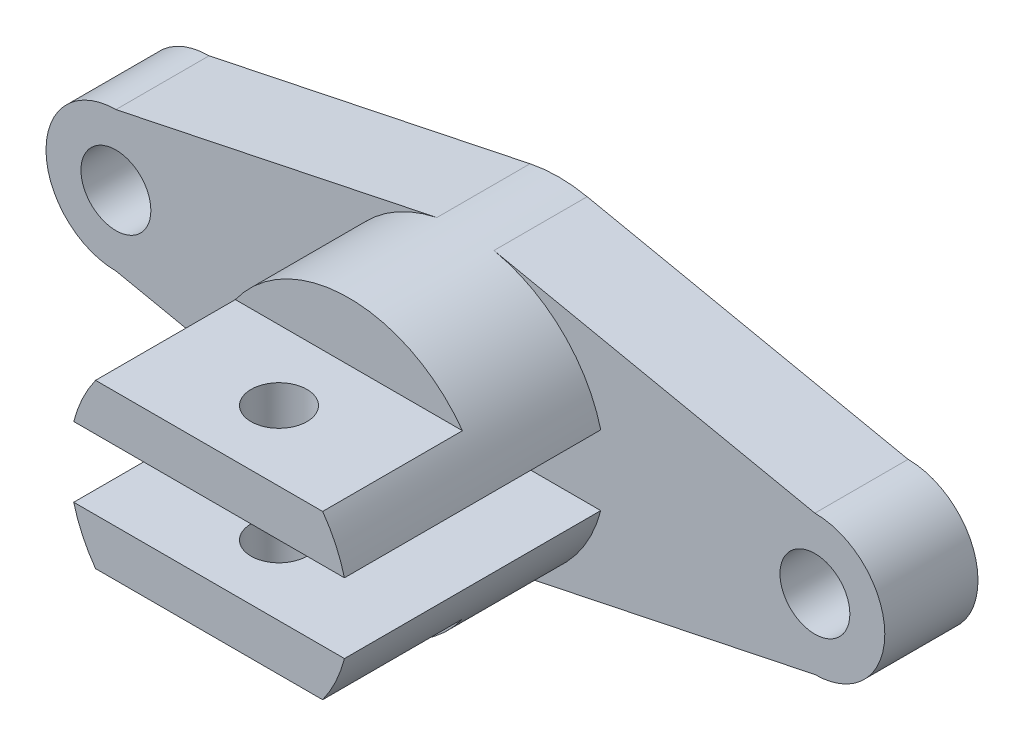
ISO-10303-21;
HEADER;
FILE_DESCRIPTION(('STEP AP214'),'2;1');
FILE_NAME('part.step','',(''),(''),'','','');
FILE_SCHEMA(('AUTOMOTIVE_DESIGN { 1 0 10303 214 1 1 1 1 }'));
ENDSEC;
DATA;
#1=APPLICATION_CONTEXT('core data for automotive mechanical design processes');
#2=APPLICATION_PROTOCOL_DEFINITION('international standard','automotive_design',2000,#1);
#3=PRODUCT_CONTEXT('',#1,'mechanical');
#4=PRODUCT('Part','Part','',(#3));
#5=PRODUCT_RELATED_PRODUCT_CATEGORY('part','',(#4));
#6=PRODUCT_DEFINITION_FORMATION('','',#4);
#7=PRODUCT_DEFINITION_CONTEXT('part definition',#1,'design');
#8=PRODUCT_DEFINITION('design','',#6,#7);
#9=PRODUCT_DEFINITION_SHAPE('','',#8);
#10=(LENGTH_UNIT() NAMED_UNIT(*) SI_UNIT(.MILLI.,.METRE.));
#11=(NAMED_UNIT(*) PLANE_ANGLE_UNIT() SI_UNIT($,.RADIAN.));
#12=(NAMED_UNIT(*) SI_UNIT($,.STERADIAN.) SOLID_ANGLE_UNIT());
#13=UNCERTAINTY_MEASURE_WITH_UNIT(LENGTH_MEASURE(1.E-05),#10,'distance_accuracy_value','');
#14=(GEOMETRIC_REPRESENTATION_CONTEXT(3) GLOBAL_UNCERTAINTY_ASSIGNED_CONTEXT((#13)) GLOBAL_UNIT_ASSIGNED_CONTEXT((#10,
#11,#12)) REPRESENTATION_CONTEXT('',''));
#15=CARTESIAN_POINT('',(0.,0.,0.));
#16=DIRECTION('',(0.,0.,1.));
#17=DIRECTION('',(1.,0.,0.));
#18=AXIS2_PLACEMENT_3D('',#15,#16,#17);
#19=CARTESIAN_POINT('',(-6.12644335404989,29.3677832297506,20.));
#20=DIRECTION('',(-0.20421477846833,0.978926107658352,0.));
#21=DIRECTION('',(-0.978926107658352,-0.20421477846833,0.));
#22=AXIS2_PLACEMENT_3D('',#19,#20,#21);
#23=PLANE('',#22);
#24=DIRECTION('',(0.978926107658352,0.20421477846833,0.));
#25=VECTOR('',#24,1.);
#26=CARTESIAN_POINT('',(-6.12644335404989,29.3677832297506,0.));
#27=LINE('',#26,#25);
#28=CARTESIAN_POINT('',(-75.,15.,0.));
#29=VERTEX_POINT('',#28);
#30=CARTESIAN_POINT('',(-6.12644335404989,29.3677832297506,0.));
#31=VERTEX_POINT('',#30);
#32=EDGE_CURVE('E223',#29,#31,#27,.T.);
#33=ORIENTED_EDGE('',*,*,#32,.F.);
#34=DIRECTION('',(0.,0.,-1.));
#35=VECTOR('',#34,1.);
#36=CARTESIAN_POINT('',(-75.,15.,20.));
#37=LINE('',#36,#35);
#38=CARTESIAN_POINT('',(-75.,15.,20.));
#39=VERTEX_POINT('',#38);
#40=EDGE_CURVE('E57',#39,#29,#37,.T.);
#41=ORIENTED_EDGE('',*,*,#40,.F.);
#42=DIRECTION('',(0.978926107658352,0.20421477846833,0.));
#43=VECTOR('',#42,1.);
#44=CARTESIAN_POINT('',(-6.12644335404989,29.3677832297506,20.));
#45=LINE('',#44,#43);
#46=CARTESIAN_POINT('',(-6.12644335404989,29.3677832297506,20.));
#47=VERTEX_POINT('',#46);
#48=EDGE_CURVE('E233',#39,#47,#45,.T.);
#49=ORIENTED_EDGE('',*,*,#48,.T.);
#50=DIRECTION('',(0.,0.,-1.));
#51=VECTOR('',#50,1.);
#52=CARTESIAN_POINT('',(-6.12644335404989,29.3677832297506,20.));
#53=LINE('',#52,#51);
#54=EDGE_CURVE('E11',#47,#31,#53,.T.);
#55=ORIENTED_EDGE('',*,*,#54,.T.);
#56=EDGE_LOOP('',(#33,#41,#49,#55));
#57=FACE_BOUND('',#56,.T.);
#58=ADVANCED_FACE('F47',(#57),#23,.T.);
#59=CARTESIAN_POINT('',(-75.,0.,20.));
#60=DIRECTION('',(0.,0.,-1.));
#61=DIRECTION('',(-1.,0.,0.));
#62=AXIS2_PLACEMENT_3D('',#59,#60,#61);
#63=CYLINDRICAL_SURFACE('',#62,15.);
#64=CARTESIAN_POINT('',(-75.,0.,0.));
#65=DIRECTION('',(0.,0.,1.));
#66=DIRECTION('',(1.,0.,0.));
#67=AXIS2_PLACEMENT_3D('',#64,#65,#66);
#68=CIRCLE('',#67,15.);
#69=CARTESIAN_POINT('',(-75.,-15.,0.));
#70=VERTEX_POINT('',#69);
#71=EDGE_CURVE('E262',#29,#70,#68,.T.);
#72=ORIENTED_EDGE('',*,*,#71,.T.);
#73=DIRECTION('',(0.,0.,-1.));
#74=VECTOR('',#73,1.);
#75=CARTESIAN_POINT('',(-75.,-15.,20.));
#76=LINE('',#75,#74);
#77=CARTESIAN_POINT('',(-75.,-15.,20.));
#78=VERTEX_POINT('',#77);
#79=EDGE_CURVE('E300',#78,#70,#76,.T.);
#80=ORIENTED_EDGE('',*,*,#79,.F.);
#81=CARTESIAN_POINT('',(-75.,0.,20.));
#82=DIRECTION('',(0.,0.,1.));
#83=DIRECTION('',(1.,0.,0.));
#84=AXIS2_PLACEMENT_3D('',#81,#82,#83);
#85=CIRCLE('',#84,15.);
#86=EDGE_CURVE('E237',#39,#78,#85,.T.);
#87=ORIENTED_EDGE('',*,*,#86,.F.);
#88=ORIENTED_EDGE('',*,*,#40,.T.);
#89=EDGE_LOOP('',(#72,#80,#87,#88));
#90=FACE_BOUND('',#89,.T.);
#91=ADVANCED_FACE('F308',(#90),#63,.T.);
#92=CARTESIAN_POINT('',(-6.12644335404988,-29.3677832297505,20.));
#93=DIRECTION('',(0.204214778468329,0.978926107658352,0.));
#94=DIRECTION('',(-0.978926107658352,0.204214778468329,0.));
#95=AXIS2_PLACEMENT_3D('',#92,#93,#94);
#96=PLANE('',#95);
#97=DIRECTION('',(0.978926107658352,-0.204214778468329,0.));
#98=VECTOR('',#97,1.);
#99=CARTESIAN_POINT('',(-6.12644335404988,-29.3677832297505,0.));
#100=LINE('',#99,#98);
#101=CARTESIAN_POINT('',(-6.12644335404989,-29.3677832297505,0.));
#102=VERTEX_POINT('',#101);
#103=EDGE_CURVE('E265',#70,#102,#100,.T.);
#104=ORIENTED_EDGE('',*,*,#103,.T.);
#105=DIRECTION('',(0.,0.,-1.));
#106=VECTOR('',#105,1.);
#107=CARTESIAN_POINT('',(-6.12644335404989,-29.3677832297505,20.));
#108=LINE('',#107,#106);
#109=CARTESIAN_POINT('',(-6.12644335404988,-29.3677832297505,20.));
#110=VERTEX_POINT('',#109);
#111=EDGE_CURVE('E296',#110,#102,#108,.T.);
#112=ORIENTED_EDGE('',*,*,#111,.F.);
#113=DIRECTION('',(0.978926107658352,-0.204214778468329,0.));
#114=VECTOR('',#113,1.);
#115=CARTESIAN_POINT('',(-6.12644335404988,-29.3677832297505,20.));
#116=LINE('',#115,#114);
#117=EDGE_CURVE('E240',#78,#110,#116,.T.);
#118=ORIENTED_EDGE('',*,*,#117,.F.);
#119=ORIENTED_EDGE('',*,*,#79,.T.);
#120=EDGE_LOOP('',(#104,#112,#118,#119));
#121=FACE_BOUND('',#120,.T.);
#122=ADVANCED_FACE('F386',(#121),#96,.F.);
#123=CARTESIAN_POINT('',(6.12644335404989,-29.3677832297506,20.));
#124=DIRECTION('',(0.20421477846833,-0.978926107658352,0.));
#125=DIRECTION('',(0.978926107658352,0.20421477846833,0.));
#126=AXIS2_PLACEMENT_3D('',#123,#124,#125);
#127=PLANE('',#126);
#128=DIRECTION('',(-0.978926107658352,-0.20421477846833,0.));
#129=VECTOR('',#128,1.);
#130=CARTESIAN_POINT('',(6.12644335404989,-29.3677832297506,0.));
#131=LINE('',#130,#129);
#132=CARTESIAN_POINT('',(75.,-15.,0.));
#133=VERTEX_POINT('',#132);
#134=CARTESIAN_POINT('',(6.12644335404989,-29.3677832297506,0.));
#135=VERTEX_POINT('',#134);
#136=EDGE_CURVE('E269',#133,#135,#131,.T.);
#137=ORIENTED_EDGE('',*,*,#136,.F.);
#138=DIRECTION('',(0.,0.,-1.));
#139=VECTOR('',#138,1.);
#140=CARTESIAN_POINT('',(75.,-15.,20.));
#141=LINE('',#140,#139);
#142=CARTESIAN_POINT('',(75.,-15.,20.));
#143=VERTEX_POINT('',#142);
#144=EDGE_CURVE('E291',#143,#133,#141,.T.);
#145=ORIENTED_EDGE('',*,*,#144,.F.);
#146=DIRECTION('',(-0.978926107658352,-0.20421477846833,0.));
#147=VECTOR('',#146,1.);
#148=CARTESIAN_POINT('',(6.12644335404989,-29.3677832297506,20.));
#149=LINE('',#148,#147);
#150=CARTESIAN_POINT('',(6.12644335404989,-29.3677832297506,20.));
#151=VERTEX_POINT('',#150);
#152=EDGE_CURVE('E137',#143,#151,#149,.T.);
#153=ORIENTED_EDGE('',*,*,#152,.T.);
#154=DIRECTION('',(0.,0.,-1.));
#155=VECTOR('',#154,1.);
#156=CARTESIAN_POINT('',(6.12644335404989,-29.3677832297506,20.));
#157=LINE('',#156,#155);
#158=EDGE_CURVE('E134',#151,#135,#157,.T.);
#159=ORIENTED_EDGE('',*,*,#158,.T.);
#160=EDGE_LOOP('',(#137,#145,#153,#159));
#161=FACE_BOUND('',#160,.T.);
#162=ADVANCED_FACE('F390',(#161),#127,.T.);
#163=CARTESIAN_POINT('',(75.,0.,20.));
#164=DIRECTION('',(0.,0.,-1.));
#165=DIRECTION('',(-1.,0.,0.));
#166=AXIS2_PLACEMENT_3D('',#163,#164,#165);
#167=CYLINDRICAL_SURFACE('',#166,15.);
#168=CARTESIAN_POINT('',(75.,0.,0.));
#169=DIRECTION('',(0.,0.,1.));
#170=DIRECTION('',(1.,0.,0.));
#171=AXIS2_PLACEMENT_3D('',#168,#169,#170);
#172=CIRCLE('',#171,15.);
#173=CARTESIAN_POINT('',(75.,15.,0.));
#174=VERTEX_POINT('',#173);
#175=EDGE_CURVE('E88',#133,#174,#172,.T.);
#176=ORIENTED_EDGE('',*,*,#175,.T.);
#177=DIRECTION('',(0.,0.,-1.));
#178=VECTOR('',#177,1.);
#179=CARTESIAN_POINT('',(75.,15.,20.));
#180=LINE('',#179,#178);
#181=CARTESIAN_POINT('',(75.,15.,20.));
#182=VERTEX_POINT('',#181);
#183=EDGE_CURVE('E288',#182,#174,#180,.T.);
#184=ORIENTED_EDGE('',*,*,#183,.F.);
#185=CARTESIAN_POINT('',(75.,0.,20.));
#186=DIRECTION('',(0.,0.,1.));
#187=DIRECTION('',(1.,0.,0.));
#188=AXIS2_PLACEMENT_3D('',#185,#186,#187);
#189=CIRCLE('',#188,15.);
#190=EDGE_CURVE('E65',#143,#182,#189,.T.);
#191=ORIENTED_EDGE('',*,*,#190,.F.);
#192=ORIENTED_EDGE('',*,*,#144,.T.);
#193=EDGE_LOOP('',(#176,#184,#191,#192));
#194=FACE_BOUND('',#193,.T.);
#195=ADVANCED_FACE('F396',(#194),#167,.T.);
#196=CARTESIAN_POINT('',(-75.,0.,20.));
#197=DIRECTION('',(0.,0.,-1.));
#198=DIRECTION('',(-1.,0.,0.));
#199=AXIS2_PLACEMENT_3D('',#196,#197,#198);
#200=CYLINDRICAL_SURFACE('',#199,7.5);
#201=CARTESIAN_POINT('',(-75.,0.,20.));
#202=DIRECTION('',(0.,0.,1.));
#203=DIRECTION('',(1.,0.,0.));
#204=AXIS2_PLACEMENT_3D('',#201,#202,#203);
#205=CIRCLE('',#204,7.5);
#206=CARTESIAN_POINT('',(-67.5,0.,20.));
#207=VERTEX_POINT('',#206);
#208=EDGE_CURVE('E251',#207,#207,#205,.T.);
#209=ORIENTED_EDGE('',*,*,#208,.T.);
#210=EDGE_LOOP('',(#209));
#211=FACE_BOUND('',#210,.T.);
#212=CARTESIAN_POINT('',(-75.,0.,0.));
#213=DIRECTION('',(0.,0.,1.));
#214=DIRECTION('',(1.,0.,0.));
#215=AXIS2_PLACEMENT_3D('',#212,#213,#214);
#216=CIRCLE('',#215,7.5);
#217=CARTESIAN_POINT('',(-67.5,0.,0.));
#218=VERTEX_POINT('',#217);
#219=EDGE_CURVE('E279',#218,#218,#216,.T.);
#220=ORIENTED_EDGE('',*,*,#219,.F.);
#221=EDGE_LOOP('',(#220));
#222=FACE_BOUND('',#221,.T.);
#223=ADVANCED_FACE('F399',(#211,#222),#200,.F.);
#224=CARTESIAN_POINT('',(6.12644335404989,29.3677832297506,20.));
#225=DIRECTION('',(-0.20421477846833,-0.978926107658352,0.));
#226=DIRECTION('',(0.978926107658352,-0.20421477846833,0.));
#227=AXIS2_PLACEMENT_3D('',#224,#225,#226);
#228=PLANE('',#227);
#229=DIRECTION('',(-0.978926107658352,0.20421477846833,0.));
#230=VECTOR('',#229,1.);
#231=CARTESIAN_POINT('',(6.12644335404989,29.3677832297506,0.));
#232=LINE('',#231,#230);
#233=CARTESIAN_POINT('',(6.12644335404989,29.3677832297506,0.));
#234=VERTEX_POINT('',#233);
#235=EDGE_CURVE('E275',#174,#234,#232,.T.);
#236=ORIENTED_EDGE('',*,*,#235,.T.);
#237=DIRECTION('',(0.,0.,-1.));
#238=VECTOR('',#237,1.);
#239=CARTESIAN_POINT('',(6.12644335404989,29.3677832297506,20.));
#240=LINE('',#239,#238);
#241=CARTESIAN_POINT('',(6.12644335404989,29.3677832297506,20.));
#242=VERTEX_POINT('',#241);
#243=EDGE_CURVE('E259',#242,#234,#240,.T.);
#244=ORIENTED_EDGE('',*,*,#243,.F.);
#245=DIRECTION('',(-0.978926107658352,0.20421477846833,0.));
#246=VECTOR('',#245,1.);
#247=CARTESIAN_POINT('',(6.12644335404989,29.3677832297506,20.));
#248=LINE('',#247,#246);
#249=EDGE_CURVE('E248',#182,#242,#248,.T.);
#250=ORIENTED_EDGE('',*,*,#249,.F.);
#251=ORIENTED_EDGE('',*,*,#183,.T.);
#252=EDGE_LOOP('',(#236,#244,#250,#251));
#253=FACE_BOUND('',#252,.T.);
#254=ADVANCED_FACE('F400',(#253),#228,.F.);
#255=CARTESIAN_POINT('',(75.,0.,20.));
#256=DIRECTION('',(0.,0.,-1.));
#257=DIRECTION('',(-1.,0.,0.));
#258=AXIS2_PLACEMENT_3D('',#255,#256,#257);
#259=CYLINDRICAL_SURFACE('',#258,7.5);
#260=CARTESIAN_POINT('',(75.,0.,20.));
#261=DIRECTION('',(0.,0.,1.));
#262=DIRECTION('',(1.,0.,0.));
#263=AXIS2_PLACEMENT_3D('',#260,#261,#262);
#264=CIRCLE('',#263,7.5);
#265=CARTESIAN_POINT('',(82.5,0.,20.));
#266=VERTEX_POINT('',#265);
#267=EDGE_CURVE('E255',#266,#266,#264,.T.);
#268=ORIENTED_EDGE('',*,*,#267,.T.);
#269=EDGE_LOOP('',(#268));
#270=FACE_BOUND('',#269,.T.);
#271=CARTESIAN_POINT('',(75.,0.,0.));
#272=DIRECTION('',(0.,0.,1.));
#273=DIRECTION('',(1.,0.,0.));
#274=AXIS2_PLACEMENT_3D('',#271,#272,#273);
#275=CIRCLE('',#274,7.5);
#276=CARTESIAN_POINT('',(82.5,0.,0.));
#277=VERTEX_POINT('',#276);
#278=EDGE_CURVE('E229',#277,#277,#275,.T.);
#279=ORIENTED_EDGE('',*,*,#278,.F.);
#280=EDGE_LOOP('',(#279));
#281=FACE_BOUND('',#280,.T.);
#282=ADVANCED_FACE('F403',(#270,#281),#259,.F.);
#283=CARTESIAN_POINT('',(0.,0.,20.));
#284=DIRECTION('',(0.,0.,1.));
#285=DIRECTION('',(1.,0.,0.));
#286=AXIS2_PLACEMENT_3D('',#283,#284,#285);
#287=PLANE('',#286);
#288=CARTESIAN_POINT('',(0.,0.,20.));
#289=DIRECTION('',(0.,0.,1.));
#290=DIRECTION('',(1.,0.,0.));
#291=AXIS2_PLACEMENT_3D('',#288,#289,#290);
#292=CIRCLE('',#291,30.);
#293=CARTESIAN_POINT('',(29.0473750965556,7.5,20.));
#294=VERTEX_POINT('',#293);
#295=EDGE_CURVE('E103',#294,#242,#292,.T.);
#296=ORIENTED_EDGE('',*,*,#295,.F.);
#297=DIRECTION('',(1.,0.,0.));
#298=VECTOR('',#297,1.);
#299=CARTESIAN_POINT('',(0.,7.5,20.));
#300=LINE('',#299,#298);
#301=CARTESIAN_POINT('',(-29.0473750965556,7.5,20.));
#302=VERTEX_POINT('',#301);
#303=EDGE_CURVE('E228',#302,#294,#300,.T.);
#304=ORIENTED_EDGE('',*,*,#303,.F.);
#305=EDGE_CURVE('E230',#47,#302,#292,.T.);
#306=ORIENTED_EDGE('',*,*,#305,.F.);
#307=ORIENTED_EDGE('',*,*,#48,.F.);
#308=ORIENTED_EDGE('',*,*,#86,.T.);
#309=ORIENTED_EDGE('',*,*,#117,.T.);
#310=CARTESIAN_POINT('',(0.,0.,20.));
#311=DIRECTION('',(0.,0.,1.));
#312=DIRECTION('',(1.,0.,0.));
#313=AXIS2_PLACEMENT_3D('',#310,#311,#312);
#314=CIRCLE('',#313,30.);
#315=CARTESIAN_POINT('',(-29.0473750965556,-7.5,20.));
#316=VERTEX_POINT('',#315);
#317=EDGE_CURVE('E140',#316,#110,#314,.T.);
#318=ORIENTED_EDGE('',*,*,#317,.F.);
#319=DIRECTION('',(1.,0.,0.));
#320=VECTOR('',#319,1.);
#321=CARTESIAN_POINT('',(0.,-7.5,20.));
#322=LINE('',#321,#320);
#323=CARTESIAN_POINT('',(29.0473750965556,-7.5,20.));
#324=VERTEX_POINT('',#323);
#325=EDGE_CURVE('E138',#316,#324,#322,.T.);
#326=ORIENTED_EDGE('',*,*,#325,.T.);
#327=EDGE_CURVE('E123',#151,#324,#314,.T.);
#328=ORIENTED_EDGE('',*,*,#327,.F.);
#329=ORIENTED_EDGE('',*,*,#152,.F.);
#330=ORIENTED_EDGE('',*,*,#190,.T.);
#331=ORIENTED_EDGE('',*,*,#249,.T.);
#332=EDGE_LOOP('',(#296,#304,#306,#307,#308,#309,#318,#326,#328,#329,#330,#331));
#333=FACE_BOUND('',#332,.T.);
#334=ORIENTED_EDGE('',*,*,#208,.F.);
#335=EDGE_LOOP('',(#334));
#336=FACE_BOUND('',#335,.T.);
#337=ORIENTED_EDGE('',*,*,#267,.F.);
#338=EDGE_LOOP('',(#337));
#339=FACE_BOUND('',#338,.T.);
#340=ADVANCED_FACE('F142',(#333,#336,#339),#287,.T.);
#341=CARTESIAN_POINT('',(0.,0.,0.));
#342=DIRECTION('',(0.,0.,1.));
#343=DIRECTION('',(1.,0.,0.));
#344=AXIS2_PLACEMENT_3D('',#341,#342,#343);
#345=PLANE('',#344);
#346=ORIENTED_EDGE('',*,*,#32,.T.);
#347=CARTESIAN_POINT('',(0.,0.,0.));
#348=DIRECTION('',(0.,0.,1.));
#349=DIRECTION('',(1.,0.,0.));
#350=AXIS2_PLACEMENT_3D('',#347,#348,#349);
#351=CIRCLE('',#350,30.);
#352=EDGE_CURVE('E96',#234,#31,#351,.T.);
#353=ORIENTED_EDGE('',*,*,#352,.F.);
#354=ORIENTED_EDGE('',*,*,#235,.F.);
#355=ORIENTED_EDGE('',*,*,#175,.F.);
#356=ORIENTED_EDGE('',*,*,#136,.T.);
#357=CARTESIAN_POINT('',(0.,0.,0.));
#358=DIRECTION('',(0.,0.,1.));
#359=DIRECTION('',(1.,0.,0.));
#360=AXIS2_PLACEMENT_3D('',#357,#358,#359);
#361=CIRCLE('',#360,30.);
#362=EDGE_CURVE('E204',#102,#135,#361,.T.);
#363=ORIENTED_EDGE('',*,*,#362,.F.);
#364=ORIENTED_EDGE('',*,*,#103,.F.);
#365=ORIENTED_EDGE('',*,*,#71,.F.);
#366=EDGE_LOOP('',(#346,#353,#354,#355,#356,#363,#364,#365));
#367=FACE_BOUND('',#366,.T.);
#368=ORIENTED_EDGE('',*,*,#219,.T.);
#369=EDGE_LOOP('',(#368));
#370=FACE_BOUND('',#369,.T.);
#371=ORIENTED_EDGE('',*,*,#278,.T.);
#372=EDGE_LOOP('',(#371));
#373=FACE_BOUND('',#372,.T.);
#374=ADVANCED_FACE('F314',(#367,#370,#373),#345,.F.);
#375=CARTESIAN_POINT('',(0.,0.,45.));
#376=DIRECTION('',(0.,0.,-1.));
#377=DIRECTION('',(-1.,0.,0.));
#378=AXIS2_PLACEMENT_3D('',#375,#376,#377);
#379=CYLINDRICAL_SURFACE('',#378,30.);
#380=ORIENTED_EDGE('',*,*,#352,.T.);
#381=ORIENTED_EDGE('',*,*,#54,.F.);
#382=ORIENTED_EDGE('',*,*,#305,.T.);
#383=DIRECTION('',(0.,0.,-1.));
#384=VECTOR('',#383,1.);
#385=CARTESIAN_POINT('',(-29.0473750965556,7.5,75.));
#386=LINE('',#385,#384);
#387=CARTESIAN_POINT('',(-29.0473750965556,7.5,75.));
#388=VERTEX_POINT('',#387);
#389=EDGE_CURVE('E188',#388,#302,#386,.T.);
#390=ORIENTED_EDGE('',*,*,#389,.F.);
#391=CARTESIAN_POINT('',(0.,0.,75.));
#392=DIRECTION('',(0.,0.,1.));
#393=DIRECTION('',(1.,0.,0.));
#394=AXIS2_PLACEMENT_3D('',#391,#392,#393);
#395=CIRCLE('',#394,30.);
#396=CARTESIAN_POINT('',(-24.3669858620224,17.5,75.));
#397=VERTEX_POINT('',#396);
#398=EDGE_CURVE('E184',#397,#388,#395,.T.);
#399=ORIENTED_EDGE('',*,*,#398,.F.);
#400=DIRECTION('',(0.,0.,-1.));
#401=VECTOR('',#400,1.);
#402=CARTESIAN_POINT('',(-24.3669858620224,17.5,75.));
#403=LINE('',#402,#401);
#404=CARTESIAN_POINT('',(-24.3669858620224,17.5,45.));
#405=VERTEX_POINT('',#404);
#406=EDGE_CURVE('E192',#397,#405,#403,.T.);
#407=ORIENTED_EDGE('',*,*,#406,.T.);
#408=CARTESIAN_POINT('',(0.,0.,45.));
#409=DIRECTION('',(0.,0.,1.));
#410=DIRECTION('',(1.,0.,0.));
#411=AXIS2_PLACEMENT_3D('',#408,#409,#410);
#412=CIRCLE('',#411,30.);
#413=CARTESIAN_POINT('',(24.3669858620224,17.5,45.));
#414=VERTEX_POINT('',#413);
#415=EDGE_CURVE('E219',#414,#405,#412,.T.);
#416=ORIENTED_EDGE('',*,*,#415,.F.);
#417=DIRECTION('',(0.,0.,-1.));
#418=VECTOR('',#417,1.);
#419=CARTESIAN_POINT('',(24.3669858620224,17.5,75.));
#420=LINE('',#419,#418);
#421=CARTESIAN_POINT('',(24.3669858620224,17.5,75.));
#422=VERTEX_POINT('',#421);
#423=EDGE_CURVE('E196',#422,#414,#420,.T.);
#424=ORIENTED_EDGE('',*,*,#423,.F.);
#425=CARTESIAN_POINT('',(29.0473750965556,7.5,75.));
#426=VERTEX_POINT('',#425);
#427=EDGE_CURVE('E179',#426,#422,#395,.T.);
#428=ORIENTED_EDGE('',*,*,#427,.F.);
#429=DIRECTION('',(0.,0.,-1.));
#430=VECTOR('',#429,1.);
#431=CARTESIAN_POINT('',(29.0473750965556,7.5,75.));
#432=LINE('',#431,#430);
#433=EDGE_CURVE('E200',#426,#294,#432,.T.);
#434=ORIENTED_EDGE('',*,*,#433,.T.);
#435=ORIENTED_EDGE('',*,*,#295,.T.);
#436=ORIENTED_EDGE('',*,*,#243,.T.);
#437=EDGE_LOOP('',(#380,#381,#382,#390,#399,#407,#416,#424,#428,#434,#435,#436));
#438=FACE_BOUND('',#437,.T.);
#439=ADVANCED_FACE('F323',(#438),#379,.T.);
#440=CARTESIAN_POINT('',(0.,0.,45.));
#441=DIRECTION('',(0.,0.,1.));
#442=DIRECTION('',(1.,0.,0.));
#443=AXIS2_PLACEMENT_3D('',#440,#441,#442);
#444=PLANE('',#443);
#445=DIRECTION('',(-1.,0.,0.));
#446=VECTOR('',#445,1.);
#447=CARTESIAN_POINT('',(0.,17.5,45.));
#448=LINE('',#447,#446);
#449=EDGE_CURVE('E215',#414,#405,#448,.T.);
#450=ORIENTED_EDGE('',*,*,#449,.F.);
#451=ORIENTED_EDGE('',*,*,#415,.T.);
#452=EDGE_LOOP('',(#450,#451));
#453=FACE_BOUND('',#452,.T.);
#454=ADVANCED_FACE('F363',(#453),#444,.T.);
#455=CARTESIAN_POINT('',(0.,0.,45.));
#456=DIRECTION('',(0.,0.,-1.));
#457=DIRECTION('',(-1.,0.,0.));
#458=AXIS2_PLACEMENT_3D('',#455,#456,#457);
#459=CYLINDRICAL_SURFACE('',#458,30.);
#460=ORIENTED_EDGE('',*,*,#362,.T.);
#461=ORIENTED_EDGE('',*,*,#158,.F.);
#462=ORIENTED_EDGE('',*,*,#327,.T.);
#463=DIRECTION('',(0.,0.,-1.));
#464=VECTOR('',#463,1.);
#465=CARTESIAN_POINT('',(29.0473750965556,-7.5,75.));
#466=LINE('',#465,#464);
#467=CARTESIAN_POINT('',(29.0473750965556,-7.5,75.));
#468=VERTEX_POINT('',#467);
#469=EDGE_CURVE('E130',#468,#324,#466,.T.);
#470=ORIENTED_EDGE('',*,*,#469,.F.);
#471=CARTESIAN_POINT('',(0.,0.,75.));
#472=DIRECTION('',(0.,0.,1.));
#473=DIRECTION('',(1.,0.,0.));
#474=AXIS2_PLACEMENT_3D('',#471,#472,#473);
#475=CIRCLE('',#474,30.);
#476=CARTESIAN_POINT('',(24.3669858620224,-17.5,75.));
#477=VERTEX_POINT('',#476);
#478=EDGE_CURVE('E156',#477,#468,#475,.T.);
#479=ORIENTED_EDGE('',*,*,#478,.F.);
#480=DIRECTION('',(0.,0.,-1.));
#481=VECTOR('',#480,1.);
#482=CARTESIAN_POINT('',(24.3669858620224,-17.5,75.));
#483=LINE('',#482,#481);
#484=CARTESIAN_POINT('',(24.3669858620224,-17.5,45.));
#485=VERTEX_POINT('',#484);
#486=EDGE_CURVE('E155',#477,#485,#483,.T.);
#487=ORIENTED_EDGE('',*,*,#486,.T.);
#488=CARTESIAN_POINT('',(0.,0.,45.));
#489=DIRECTION('',(0.,0.,1.));
#490=DIRECTION('',(1.,0.,0.));
#491=AXIS2_PLACEMENT_3D('',#488,#489,#490);
#492=CIRCLE('',#491,30.);
#493=CARTESIAN_POINT('',(-24.3669858620224,-17.5,45.));
#494=VERTEX_POINT('',#493);
#495=EDGE_CURVE('E209',#494,#485,#492,.T.);
#496=ORIENTED_EDGE('',*,*,#495,.F.);
#497=DIRECTION('',(0.,0.,-1.));
#498=VECTOR('',#497,1.);
#499=CARTESIAN_POINT('',(-24.3669858620224,-17.5,75.));
#500=LINE('',#499,#498);
#501=CARTESIAN_POINT('',(-24.3669858620224,-17.5,75.));
#502=VERTEX_POINT('',#501);
#503=EDGE_CURVE('E161',#502,#494,#500,.T.);
#504=ORIENTED_EDGE('',*,*,#503,.F.);
#505=CARTESIAN_POINT('',(-29.0473750965556,-7.5,75.));
#506=VERTEX_POINT('',#505);
#507=EDGE_CURVE('E166',#506,#502,#475,.T.);
#508=ORIENTED_EDGE('',*,*,#507,.F.);
#509=DIRECTION('',(0.,0.,-1.));
#510=VECTOR('',#509,1.);
#511=CARTESIAN_POINT('',(-29.0473750965556,-7.5,75.));
#512=LINE('',#511,#510);
#513=EDGE_CURVE('E172',#506,#316,#512,.T.);
#514=ORIENTED_EDGE('',*,*,#513,.T.);
#515=ORIENTED_EDGE('',*,*,#317,.T.);
#516=ORIENTED_EDGE('',*,*,#111,.T.);
#517=EDGE_LOOP('',(#460,#461,#462,#470,#479,#487,#496,#504,#508,#514,#515,#516));
#518=FACE_BOUND('',#517,.T.);
#519=ADVANCED_FACE('F126',(#518),#459,.T.);
#520=CARTESIAN_POINT('',(0.,0.,45.));
#521=DIRECTION('',(0.,0.,1.));
#522=DIRECTION('',(1.,0.,0.));
#523=AXIS2_PLACEMENT_3D('',#520,#521,#522);
#524=PLANE('',#523);
#525=DIRECTION('',(1.,0.,0.));
#526=VECTOR('',#525,1.);
#527=CARTESIAN_POINT('',(0.,-17.5,45.));
#528=LINE('',#527,#526);
#529=EDGE_CURVE('E205',#494,#485,#528,.T.);
#530=ORIENTED_EDGE('',*,*,#529,.F.);
#531=ORIENTED_EDGE('',*,*,#495,.T.);
#532=EDGE_LOOP('',(#530,#531));
#533=FACE_BOUND('',#532,.T.);
#534=ADVANCED_FACE('F377',(#533),#524,.T.);
#535=CARTESIAN_POINT('',(0.,0.,75.));
#536=DIRECTION('',(0.,0.,1.));
#537=DIRECTION('',(1.,0.,0.));
#538=AXIS2_PLACEMENT_3D('',#535,#536,#537);
#539=PLANE('',#538);
#540=DIRECTION('',(1.,0.,0.));
#541=VECTOR('',#540,1.);
#542=CARTESIAN_POINT('',(0.,7.5,75.));
#543=LINE('',#542,#541);
#544=EDGE_CURVE('E175',#388,#426,#543,.T.);
#545=ORIENTED_EDGE('',*,*,#544,.T.);
#546=ORIENTED_EDGE('',*,*,#427,.T.);
#547=DIRECTION('',(-1.,0.,0.));
#548=VECTOR('',#547,1.);
#549=CARTESIAN_POINT('',(0.,17.5,75.));
#550=LINE('',#549,#548);
#551=EDGE_CURVE('E183',#422,#397,#550,.T.);
#552=ORIENTED_EDGE('',*,*,#551,.T.);
#553=ORIENTED_EDGE('',*,*,#398,.T.);
#554=EDGE_LOOP('',(#545,#546,#552,#553));
#555=FACE_BOUND('',#554,.T.);
#556=ADVANCED_FACE('F331',(#555),#539,.T.);
#557=CARTESIAN_POINT('',(0.,17.5,75.));
#558=DIRECTION('',(0.,-1.,0.));
#559=DIRECTION('',(0.,0.,-1.));
#560=AXIS2_PLACEMENT_3D('',#557,#558,#559);
#561=PLANE('',#560);
#562=CARTESIAN_POINT('',(0.,17.5,60.));
#563=DIRECTION('',(0.,-1.,0.));
#564=DIRECTION('',(0.,0.,-1.));
#565=AXIS2_PLACEMENT_3D('',#562,#563,#564);
#566=CIRCLE('',#565,6.);
#567=CARTESIAN_POINT('',(0.,17.5,54.));
#568=VERTEX_POINT('',#567);
#569=EDGE_CURVE('E444',#568,#568,#566,.T.);
#570=ORIENTED_EDGE('',*,*,#569,.T.);
#571=EDGE_LOOP('',(#570));
#572=FACE_BOUND('',#571,.T.);
#573=ORIENTED_EDGE('',*,*,#449,.T.);
#574=ORIENTED_EDGE('',*,*,#406,.F.);
#575=ORIENTED_EDGE('',*,*,#551,.F.);
#576=ORIENTED_EDGE('',*,*,#423,.T.);
#577=EDGE_LOOP('',(#573,#574,#575,#576));
#578=FACE_BOUND('',#577,.T.);
#579=ADVANCED_FACE('F365',(#572,#578),#561,.F.);
#580=CARTESIAN_POINT('',(0.,7.5,75.));
#581=DIRECTION('',(0.,1.,0.));
#582=DIRECTION('',(0.,0.,1.));
#583=AXIS2_PLACEMENT_3D('',#580,#581,#582);
#584=PLANE('',#583);
#585=CARTESIAN_POINT('',(0.,7.5,60.));
#586=DIRECTION('',(0.,1.,0.));
#587=DIRECTION('',(0.,0.,1.));
#588=AXIS2_PLACEMENT_3D('',#585,#586,#587);
#589=CIRCLE('',#588,6.);
#590=CARTESIAN_POINT('',(0.,7.5,66.));
#591=VERTEX_POINT('',#590);
#592=EDGE_CURVE('E449',#591,#591,#589,.T.);
#593=ORIENTED_EDGE('',*,*,#592,.T.);
#594=EDGE_LOOP('',(#593));
#595=FACE_BOUND('',#594,.T.);
#596=ORIENTED_EDGE('',*,*,#303,.T.);
#597=ORIENTED_EDGE('',*,*,#433,.F.);
#598=ORIENTED_EDGE('',*,*,#544,.F.);
#599=ORIENTED_EDGE('',*,*,#389,.T.);
#600=EDGE_LOOP('',(#596,#597,#598,#599));
#601=FACE_BOUND('',#600,.T.);
#602=ADVANCED_FACE('F341',(#595,#601),#584,.F.);
#603=CARTESIAN_POINT('',(0.,0.,75.));
#604=DIRECTION('',(0.,0.,1.));
#605=DIRECTION('',(1.,0.,0.));
#606=AXIS2_PLACEMENT_3D('',#603,#604,#605);
#607=PLANE('',#606);
#608=DIRECTION('',(1.,0.,0.));
#609=VECTOR('',#608,1.);
#610=CARTESIAN_POINT('',(0.,-7.5,75.));
#611=LINE('',#610,#609);
#612=EDGE_CURVE('E153',#506,#468,#611,.T.);
#613=ORIENTED_EDGE('',*,*,#612,.F.);
#614=ORIENTED_EDGE('',*,*,#507,.T.);
#615=DIRECTION('',(1.,0.,0.));
#616=VECTOR('',#615,1.);
#617=CARTESIAN_POINT('',(0.,-17.5,75.));
#618=LINE('',#617,#616);
#619=EDGE_CURVE('E164',#502,#477,#618,.T.);
#620=ORIENTED_EDGE('',*,*,#619,.T.);
#621=ORIENTED_EDGE('',*,*,#478,.T.);
#622=EDGE_LOOP('',(#613,#614,#620,#621));
#623=FACE_BOUND('',#622,.T.);
#624=ADVANCED_FACE('F373',(#623),#607,.T.);
#625=CARTESIAN_POINT('',(0.,-17.5,75.));
#626=DIRECTION('',(0.,1.,0.));
#627=DIRECTION('',(0.,0.,1.));
#628=AXIS2_PLACEMENT_3D('',#625,#626,#627);
#629=PLANE('',#628);
#630=CARTESIAN_POINT('',(0.,-17.5,60.));
#631=DIRECTION('',(0.,-1.,0.));
#632=DIRECTION('',(0.,0.,-1.));
#633=AXIS2_PLACEMENT_3D('',#630,#631,#632);
#634=CIRCLE('',#633,6.);
#635=CARTESIAN_POINT('',(0.,-17.5,54.));
#636=VERTEX_POINT('',#635);
#637=EDGE_CURVE('E453',#636,#636,#634,.T.);
#638=ORIENTED_EDGE('',*,*,#637,.F.);
#639=EDGE_LOOP('',(#638));
#640=FACE_BOUND('',#639,.T.);
#641=ORIENTED_EDGE('',*,*,#529,.T.);
#642=ORIENTED_EDGE('',*,*,#486,.F.);
#643=ORIENTED_EDGE('',*,*,#619,.F.);
#644=ORIENTED_EDGE('',*,*,#503,.T.);
#645=EDGE_LOOP('',(#641,#642,#643,#644));
#646=FACE_BOUND('',#645,.T.);
#647=ADVANCED_FACE('F429',(#640,#646),#629,.F.);
#648=CARTESIAN_POINT('',(0.,-7.5,75.));
#649=DIRECTION('',(0.,1.,0.));
#650=DIRECTION('',(0.,0.,1.));
#651=AXIS2_PLACEMENT_3D('',#648,#649,#650);
#652=PLANE('',#651);
#653=CARTESIAN_POINT('',(0.,-7.50000000000001,60.));
#654=DIRECTION('',(0.,1.,0.));
#655=DIRECTION('',(0.,0.,1.));
#656=AXIS2_PLACEMENT_3D('',#653,#654,#655);
#657=CIRCLE('',#656,6.);
#658=CARTESIAN_POINT('',(0.,-7.50000000000001,66.));
#659=VERTEX_POINT('',#658);
#660=EDGE_CURVE('E50',#659,#659,#657,.T.);
#661=ORIENTED_EDGE('',*,*,#660,.F.);
#662=EDGE_LOOP('',(#661));
#663=FACE_BOUND('',#662,.T.);
#664=ORIENTED_EDGE('',*,*,#469,.T.);
#665=ORIENTED_EDGE('',*,*,#325,.F.);
#666=ORIENTED_EDGE('',*,*,#513,.F.);
#667=ORIENTED_EDGE('',*,*,#612,.T.);
#668=EDGE_LOOP('',(#664,#665,#666,#667));
#669=FACE_BOUND('',#668,.T.);
#670=ADVANCED_FACE('F151',(#663,#669),#652,.T.);
#671=CARTESIAN_POINT('',(0.,57.5,60.));
#672=DIRECTION('',(0.,-1.,0.));
#673=DIRECTION('',(0.,0.,-1.));
#674=AXIS2_PLACEMENT_3D('',#671,#672,#673);
#675=CYLINDRICAL_SURFACE('',#674,6.);
#676=ORIENTED_EDGE('',*,*,#660,.T.);
#677=EDGE_LOOP('',(#676));
#678=FACE_BOUND('',#677,.T.);
#679=ORIENTED_EDGE('',*,*,#637,.T.);
#680=EDGE_LOOP('',(#679));
#681=FACE_BOUND('',#680,.T.);
#682=ADVANCED_FACE('F462',(#678,#681),#675,.F.);
#683=ORIENTED_EDGE('',*,*,#592,.F.);
#684=EDGE_LOOP('',(#683));
#685=FACE_BOUND('',#684,.T.);
#686=ORIENTED_EDGE('',*,*,#569,.F.);
#687=EDGE_LOOP('',(#686));
#688=FACE_BOUND('',#687,.T.);
#689=ADVANCED_FACE('F470',(#685,#688),#675,.F.);
#690=CLOSED_SHELL('',(#58,#91,#122,#162,#195,#223,#254,#282,#340,#374,#439,#454,#519,#534,#556,
#579,#602,#624,#647,#670,#682,#689));
#691=MANIFOLD_SOLID_BREP('B2',#690);
#692=ADVANCED_BREP_SHAPE_REPRESENTATION('',(#18,#691),#14);
#693=SHAPE_DEFINITION_REPRESENTATION(#9,#692);
ENDSEC;
END-ISO-10303-21;
